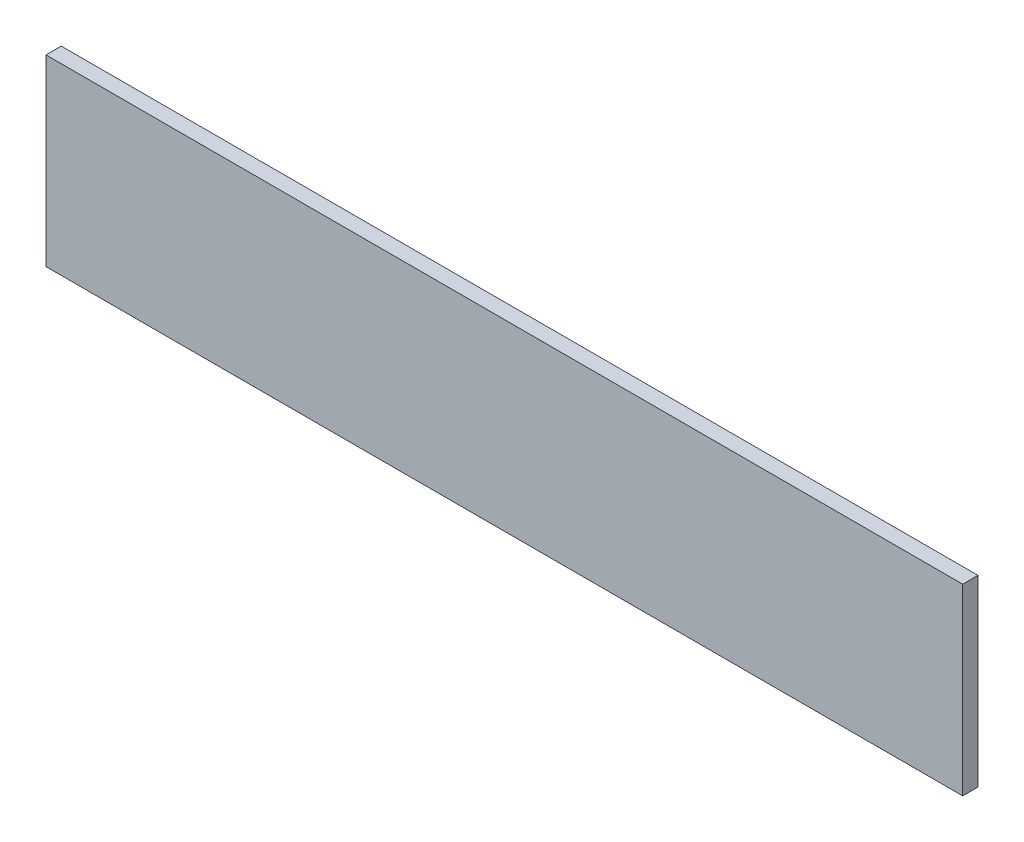
ISO-10303-21;
HEADER;
FILE_DESCRIPTION(('STEP AP214'),'2;1');
FILE_NAME('part.step','',(''),(''),'','','');
FILE_SCHEMA(('AUTOMOTIVE_DESIGN { 1 0 10303 214 1 1 1 1 }'));
ENDSEC;
DATA;
#1=APPLICATION_CONTEXT('core data for automotive mechanical design processes');
#2=APPLICATION_PROTOCOL_DEFINITION('international standard','automotive_design',2000,#1);
#3=PRODUCT_CONTEXT('',#1,'mechanical');
#4=PRODUCT('Part','Part','',(#3));
#5=PRODUCT_RELATED_PRODUCT_CATEGORY('part','',(#4));
#6=PRODUCT_DEFINITION_FORMATION('','',#4);
#7=PRODUCT_DEFINITION_CONTEXT('part definition',#1,'design');
#8=PRODUCT_DEFINITION('design','',#6,#7);
#9=PRODUCT_DEFINITION_SHAPE('','',#8);
#10=(LENGTH_UNIT() NAMED_UNIT(*) SI_UNIT(.MILLI.,.METRE.));
#11=(NAMED_UNIT(*) PLANE_ANGLE_UNIT() SI_UNIT($,.RADIAN.));
#12=(NAMED_UNIT(*) SI_UNIT($,.STERADIAN.) SOLID_ANGLE_UNIT());
#13=UNCERTAINTY_MEASURE_WITH_UNIT(LENGTH_MEASURE(1.E-05),#10,'distance_accuracy_value','');
#14=(GEOMETRIC_REPRESENTATION_CONTEXT(3) GLOBAL_UNCERTAINTY_ASSIGNED_CONTEXT((#13)) GLOBAL_UNIT_ASSIGNED_CONTEXT((#10,
#11,#12)) REPRESENTATION_CONTEXT('',''));
#15=CARTESIAN_POINT('',(0.,0.,0.));
#16=DIRECTION('',(0.,0.,1.));
#17=DIRECTION('',(1.,0.,0.));
#18=AXIS2_PLACEMENT_3D('',#15,#16,#17);
#19=CARTESIAN_POINT('',(381.,-38.1,-3.175));
#20=DIRECTION('',(0.,0.,1.));
#21=DIRECTION('',(1.,0.,0.));
#22=AXIS2_PLACEMENT_3D('',#19,#20,#21);
#23=PLANE('',#22);
#24=DIRECTION('',(0.,1.,0.));
#25=VECTOR('',#24,1.);
#26=CARTESIAN_POINT('',(0.,-38.1,-3.175));
#27=LINE('',#26,#25);
#28=CARTESIAN_POINT('',(0.,-38.1,-3.175));
#29=VERTEX_POINT('',#28);
#30=CARTESIAN_POINT('',(0.,38.1,-3.175));
#31=VERTEX_POINT('',#30);
#32=EDGE_CURVE('E98',#29,#31,#27,.T.);
#33=ORIENTED_EDGE('',*,*,#32,.T.);
#34=DIRECTION('',(-1.,0.,0.));
#35=VECTOR('',#34,1.);
#36=CARTESIAN_POINT('',(381.,38.1,-3.175));
#37=LINE('',#36,#35);
#38=CARTESIAN_POINT('',(381.,38.1,-3.175));
#39=VERTEX_POINT('',#38);
#40=EDGE_CURVE('E11',#39,#31,#37,.T.);
#41=ORIENTED_EDGE('',*,*,#40,.F.);
#42=DIRECTION('',(0.,1.,0.));
#43=VECTOR('',#42,1.);
#44=CARTESIAN_POINT('',(381.,-38.1,-3.175));
#45=LINE('',#44,#43);
#46=CARTESIAN_POINT('',(381.,-38.1,-3.175));
#47=VERTEX_POINT('',#46);
#48=EDGE_CURVE('E86',#47,#39,#45,.T.);
#49=ORIENTED_EDGE('',*,*,#48,.F.);
#50=DIRECTION('',(-1.,0.,0.));
#51=VECTOR('',#50,1.);
#52=CARTESIAN_POINT('',(381.,-38.1,-3.175));
#53=LINE('',#52,#51);
#54=EDGE_CURVE('E94',#47,#29,#53,.T.);
#55=ORIENTED_EDGE('',*,*,#54,.T.);
#56=EDGE_LOOP('',(#33,#41,#49,#55));
#57=FACE_BOUND('',#56,.T.);
#58=ADVANCED_FACE('F35',(#57),#23,.F.);
#59=CARTESIAN_POINT('',(381.,38.1,3.175));
#60=DIRECTION('',(0.,-1.,0.));
#61=DIRECTION('',(0.,0.,-1.));
#62=AXIS2_PLACEMENT_3D('',#59,#60,#61);
#63=PLANE('',#62);
#64=DIRECTION('',(0.,0.,1.));
#65=VECTOR('',#64,1.);
#66=CARTESIAN_POINT('',(0.,38.1,3.175));
#67=LINE('',#66,#65);
#68=CARTESIAN_POINT('',(0.,38.1,3.175));
#69=VERTEX_POINT('',#68);
#70=EDGE_CURVE('E90',#31,#69,#67,.T.);
#71=ORIENTED_EDGE('',*,*,#70,.T.);
#72=DIRECTION('',(-1.,0.,0.));
#73=VECTOR('',#72,1.);
#74=CARTESIAN_POINT('',(381.,38.1,3.175));
#75=LINE('',#74,#73);
#76=CARTESIAN_POINT('',(381.,38.1,3.175));
#77=VERTEX_POINT('',#76);
#78=EDGE_CURVE('E43',#77,#69,#75,.T.);
#79=ORIENTED_EDGE('',*,*,#78,.F.);
#80=DIRECTION('',(0.,0.,1.));
#81=VECTOR('',#80,1.);
#82=CARTESIAN_POINT('',(381.,38.1,3.175));
#83=LINE('',#82,#81);
#84=EDGE_CURVE('E81',#39,#77,#83,.T.);
#85=ORIENTED_EDGE('',*,*,#84,.F.);
#86=ORIENTED_EDGE('',*,*,#40,.T.);
#87=EDGE_LOOP('',(#71,#79,#85,#86));
#88=FACE_BOUND('',#87,.T.);
#89=ADVANCED_FACE('F89',(#88),#63,.F.);
#90=CARTESIAN_POINT('',(381.,-38.1,3.175));
#91=DIRECTION('',(0.,0.,-1.));
#92=DIRECTION('',(-1.,0.,0.));
#93=AXIS2_PLACEMENT_3D('',#90,#91,#92);
#94=PLANE('',#93);
#95=DIRECTION('',(0.,-1.,0.));
#96=VECTOR('',#95,1.);
#97=CARTESIAN_POINT('',(0.,-38.1,3.175));
#98=LINE('',#97,#96);
#99=CARTESIAN_POINT('',(0.,-38.1,3.175));
#100=VERTEX_POINT('',#99);
#101=EDGE_CURVE('E68',#69,#100,#98,.T.);
#102=ORIENTED_EDGE('',*,*,#101,.T.);
#103=DIRECTION('',(-1.,0.,0.));
#104=VECTOR('',#103,1.);
#105=CARTESIAN_POINT('',(381.,-38.1,3.175));
#106=LINE('',#105,#104);
#107=CARTESIAN_POINT('',(381.,-38.1,3.175));
#108=VERTEX_POINT('',#107);
#109=EDGE_CURVE('E91',#108,#100,#106,.T.);
#110=ORIENTED_EDGE('',*,*,#109,.F.);
#111=DIRECTION('',(0.,-1.,0.));
#112=VECTOR('',#111,1.);
#113=CARTESIAN_POINT('',(381.,-38.1,3.175));
#114=LINE('',#113,#112);
#115=EDGE_CURVE('E84',#77,#108,#114,.T.);
#116=ORIENTED_EDGE('',*,*,#115,.F.);
#117=ORIENTED_EDGE('',*,*,#78,.T.);
#118=EDGE_LOOP('',(#102,#110,#116,#117));
#119=FACE_BOUND('',#118,.T.);
#120=ADVANCED_FACE('F92',(#119),#94,.F.);
#121=CARTESIAN_POINT('',(381.,-38.1,3.175));
#122=DIRECTION('',(0.,1.,0.));
#123=DIRECTION('',(0.,0.,1.));
#124=AXIS2_PLACEMENT_3D('',#121,#122,#123);
#125=PLANE('',#124);
#126=DIRECTION('',(0.,0.,-1.));
#127=VECTOR('',#126,1.);
#128=CARTESIAN_POINT('',(0.,-38.1,3.175));
#129=LINE('',#128,#127);
#130=EDGE_CURVE('E74',#100,#29,#129,.T.);
#131=ORIENTED_EDGE('',*,*,#130,.T.);
#132=ORIENTED_EDGE('',*,*,#54,.F.);
#133=DIRECTION('',(0.,0.,-1.));
#134=VECTOR('',#133,1.);
#135=CARTESIAN_POINT('',(381.,-38.1,3.175));
#136=LINE('',#135,#134);
#137=EDGE_CURVE('E51',#108,#47,#136,.T.);
#138=ORIENTED_EDGE('',*,*,#137,.F.);
#139=ORIENTED_EDGE('',*,*,#109,.T.);
#140=EDGE_LOOP('',(#131,#132,#138,#139));
#141=FACE_BOUND('',#140,.T.);
#142=ADVANCED_FACE('F105',(#141),#125,.F.);
#143=CARTESIAN_POINT('',(381.,0.,0.));
#144=DIRECTION('',(-1.,0.,0.));
#145=DIRECTION('',(0.,0.,1.));
#146=AXIS2_PLACEMENT_3D('',#143,#144,#145);
#147=PLANE('',#146);
#148=ORIENTED_EDGE('',*,*,#48,.T.);
#149=ORIENTED_EDGE('',*,*,#84,.T.);
#150=ORIENTED_EDGE('',*,*,#115,.T.);
#151=ORIENTED_EDGE('',*,*,#137,.T.);
#152=EDGE_LOOP('',(#148,#149,#150,#151));
#153=FACE_BOUND('',#152,.T.);
#154=ADVANCED_FACE('F82',(#153),#147,.F.);
#155=CARTESIAN_POINT('',(0.,0.,0.));
#156=DIRECTION('',(-1.,0.,0.));
#157=DIRECTION('',(0.,0.,1.));
#158=AXIS2_PLACEMENT_3D('',#155,#156,#157);
#159=PLANE('',#158);
#160=ORIENTED_EDGE('',*,*,#32,.F.);
#161=ORIENTED_EDGE('',*,*,#130,.F.);
#162=ORIENTED_EDGE('',*,*,#101,.F.);
#163=ORIENTED_EDGE('',*,*,#70,.F.);
#164=EDGE_LOOP('',(#160,#161,#162,#163));
#165=FACE_BOUND('',#164,.T.);
#166=ADVANCED_FACE('F108',(#165),#159,.T.);
#167=CLOSED_SHELL('',(#58,#89,#120,#142,#154,#166));
#168=MANIFOLD_SOLID_BREP('B2',#167);
#169=ADVANCED_BREP_SHAPE_REPRESENTATION('',(#18,#168),#14);
#170=SHAPE_DEFINITION_REPRESENTATION(#9,#169);
ENDSEC;
END-ISO-10303-21;
